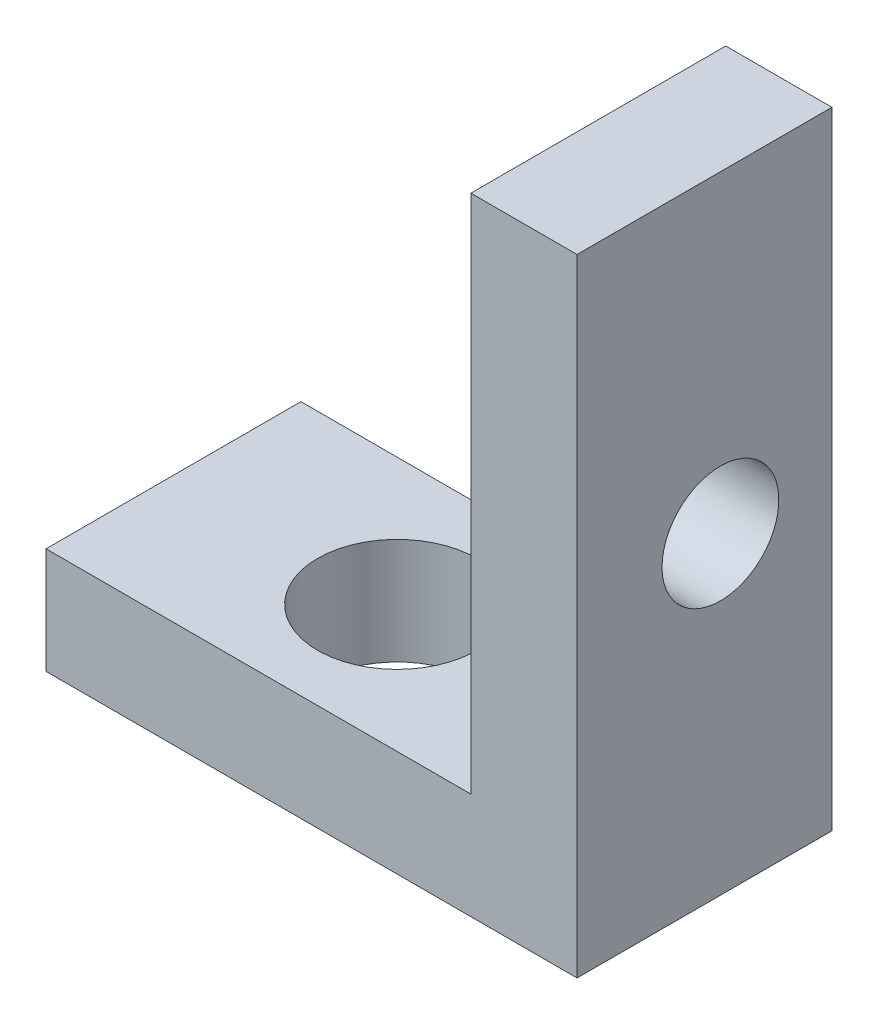
ISO-10303-21;
HEADER;
FILE_DESCRIPTION(('STEP AP214'),'2;1');
FILE_NAME('part.step','',(''),(''),'','','');
FILE_SCHEMA(('AUTOMOTIVE_DESIGN { 1 0 10303 214 1 1 1 1 }'));
ENDSEC;
DATA;
#1=APPLICATION_CONTEXT('core data for automotive mechanical design processes');
#2=APPLICATION_PROTOCOL_DEFINITION('international standard','automotive_design',2000,#1);
#3=PRODUCT_CONTEXT('',#1,'mechanical');
#4=PRODUCT('Part','Part','',(#3));
#5=PRODUCT_RELATED_PRODUCT_CATEGORY('part','',(#4));
#6=PRODUCT_DEFINITION_FORMATION('','',#4);
#7=PRODUCT_DEFINITION_CONTEXT('part definition',#1,'design');
#8=PRODUCT_DEFINITION('design','',#6,#7);
#9=PRODUCT_DEFINITION_SHAPE('','',#8);
#10=(LENGTH_UNIT() NAMED_UNIT(*) SI_UNIT(.MILLI.,.METRE.));
#11=(NAMED_UNIT(*) PLANE_ANGLE_UNIT() SI_UNIT($,.RADIAN.));
#12=(NAMED_UNIT(*) SI_UNIT($,.STERADIAN.) SOLID_ANGLE_UNIT());
#13=UNCERTAINTY_MEASURE_WITH_UNIT(LENGTH_MEASURE(1.E-05),#10,'distance_accuracy_value','');
#14=(GEOMETRIC_REPRESENTATION_CONTEXT(3) GLOBAL_UNCERTAINTY_ASSIGNED_CONTEXT((#13)) GLOBAL_UNIT_ASSIGNED_CONTEXT((#10,
#11,#12)) REPRESENTATION_CONTEXT('',''));
#15=CARTESIAN_POINT('',(0.,0.,0.));
#16=DIRECTION('',(0.,0.,1.));
#17=DIRECTION('',(1.,0.,0.));
#18=AXIS2_PLACEMENT_3D('',#15,#16,#17);
#19=CARTESIAN_POINT('',(0.,0.,4.8));
#20=DIRECTION('',(0.,1.,0.));
#21=DIRECTION('',(-1.,0.,0.));
#22=AXIS2_PLACEMENT_3D('',#19,#20,#21);
#23=PLANE('',#22);
#24=CARTESIAN_POINT('',(-5.78666309704816,0.,2.4));
#25=DIRECTION('',(0.,1.,0.));
#26=DIRECTION('',(-1.,0.,0.));
#27=AXIS2_PLACEMENT_3D('',#24,#25,#26);
#28=CIRCLE('',#27,1.5);
#29=CARTESIAN_POINT('',(-7.28666309704816,0.,2.4));
#30=VERTEX_POINT('',#29);
#31=EDGE_CURVE('E168',#30,#30,#28,.F.);
#32=ORIENTED_EDGE('',*,*,#31,.F.);
#33=EDGE_LOOP('',(#32));
#34=FACE_BOUND('',#33,.T.);
#35=DIRECTION('',(1.,0.,0.));
#36=VECTOR('',#35,1.);
#37=CARTESIAN_POINT('',(0.,0.,0.));
#38=LINE('',#37,#36);
#39=CARTESIAN_POINT('',(-10.,0.,0.));
#40=VERTEX_POINT('',#39);
#41=CARTESIAN_POINT('',(0.,0.,0.));
#42=VERTEX_POINT('',#41);
#43=EDGE_CURVE('E124',#40,#42,#38,.T.);
#44=ORIENTED_EDGE('',*,*,#43,.T.);
#45=DIRECTION('',(0.,0.,-1.));
#46=VECTOR('',#45,1.);
#47=CARTESIAN_POINT('',(0.,0.,4.8));
#48=LINE('',#47,#46);
#49=CARTESIAN_POINT('',(0.,0.,4.8));
#50=VERTEX_POINT('',#49);
#51=EDGE_CURVE('E11',#50,#42,#48,.T.);
#52=ORIENTED_EDGE('',*,*,#51,.F.);
#53=DIRECTION('',(1.,0.,0.));
#54=VECTOR('',#53,1.);
#55=CARTESIAN_POINT('',(0.,0.,4.8));
#56=LINE('',#55,#54);
#57=CARTESIAN_POINT('',(-10.,0.,4.8));
#58=VERTEX_POINT('',#57);
#59=EDGE_CURVE('E135',#58,#50,#56,.T.);
#60=ORIENTED_EDGE('',*,*,#59,.F.);
#61=DIRECTION('',(0.,0.,-1.));
#62=VECTOR('',#61,1.);
#63=CARTESIAN_POINT('',(-10.,0.,4.8));
#64=LINE('',#63,#62);
#65=EDGE_CURVE('E120',#58,#40,#64,.T.);
#66=ORIENTED_EDGE('',*,*,#65,.T.);
#67=EDGE_LOOP('',(#44,#52,#60,#66));
#68=FACE_BOUND('',#67,.T.);
#69=ADVANCED_FACE('F40',(#34,#68),#23,.F.);
#70=CARTESIAN_POINT('',(0.,0.,4.8));
#71=DIRECTION('',(-1.,0.,0.));
#72=DIRECTION('',(0.,0.,1.));
#73=AXIS2_PLACEMENT_3D('',#70,#71,#72);
#74=PLANE('',#73);
#75=CARTESIAN_POINT('',(0.,5.9,2.1));
#76=DIRECTION('',(-1.,0.,0.));
#77=DIRECTION('',(0.,0.,1.));
#78=AXIS2_PLACEMENT_3D('',#75,#76,#77);
#79=CIRCLE('',#78,1.1);
#80=CARTESIAN_POINT('',(0.,5.9,3.2));
#81=VERTEX_POINT('',#80);
#82=EDGE_CURVE('E128',#81,#81,#79,.F.);
#83=ORIENTED_EDGE('',*,*,#82,.F.);
#84=EDGE_LOOP('',(#83));
#85=FACE_BOUND('',#84,.T.);
#86=DIRECTION('',(0.,1.,0.));
#87=VECTOR('',#86,1.);
#88=CARTESIAN_POINT('',(0.,0.,0.));
#89=LINE('',#88,#87);
#90=CARTESIAN_POINT('',(0.,11.8,0.));
#91=VERTEX_POINT('',#90);
#92=EDGE_CURVE('E127',#42,#91,#89,.T.);
#93=ORIENTED_EDGE('',*,*,#92,.T.);
#94=DIRECTION('',(0.,0.,-1.));
#95=VECTOR('',#94,1.);
#96=CARTESIAN_POINT('',(0.,11.8,4.8));
#97=LINE('',#96,#95);
#98=CARTESIAN_POINT('',(0.,11.8,4.8));
#99=VERTEX_POINT('',#98);
#100=EDGE_CURVE('E48',#99,#91,#97,.T.);
#101=ORIENTED_EDGE('',*,*,#100,.F.);
#102=DIRECTION('',(0.,1.,0.));
#103=VECTOR('',#102,1.);
#104=CARTESIAN_POINT('',(0.,0.,4.8));
#105=LINE('',#104,#103);
#106=EDGE_CURVE('E93',#50,#99,#105,.T.);
#107=ORIENTED_EDGE('',*,*,#106,.F.);
#108=ORIENTED_EDGE('',*,*,#51,.T.);
#109=EDGE_LOOP('',(#93,#101,#107,#108));
#110=FACE_BOUND('',#109,.T.);
#111=ADVANCED_FACE('F160',(#85,#110),#74,.F.);
#112=CARTESIAN_POINT('',(0.,11.8,4.8));
#113=DIRECTION('',(0.,-1.,0.));
#114=DIRECTION('',(0.,0.,-1.));
#115=AXIS2_PLACEMENT_3D('',#112,#113,#114);
#116=PLANE('',#115);
#117=DIRECTION('',(-1.,0.,0.));
#118=VECTOR('',#117,1.);
#119=CARTESIAN_POINT('',(0.,11.8,0.));
#120=LINE('',#119,#118);
#121=CARTESIAN_POINT('',(-2.,11.8,0.));
#122=VERTEX_POINT('',#121);
#123=EDGE_CURVE('E130',#91,#122,#120,.T.);
#124=ORIENTED_EDGE('',*,*,#123,.T.);
#125=DIRECTION('',(0.,0.,-1.));
#126=VECTOR('',#125,1.);
#127=CARTESIAN_POINT('',(-2.,11.8,4.8));
#128=LINE('',#127,#126);
#129=CARTESIAN_POINT('',(-2.,11.8,4.8));
#130=VERTEX_POINT('',#129);
#131=EDGE_CURVE('E115',#130,#122,#128,.T.);
#132=ORIENTED_EDGE('',*,*,#131,.F.);
#133=DIRECTION('',(-1.,0.,0.));
#134=VECTOR('',#133,1.);
#135=CARTESIAN_POINT('',(0.,11.8,4.8));
#136=LINE('',#135,#134);
#137=EDGE_CURVE('E106',#99,#130,#136,.T.);
#138=ORIENTED_EDGE('',*,*,#137,.F.);
#139=ORIENTED_EDGE('',*,*,#100,.T.);
#140=EDGE_LOOP('',(#124,#132,#138,#139));
#141=FACE_BOUND('',#140,.T.);
#142=ADVANCED_FACE('F141',(#141),#116,.F.);
#143=CARTESIAN_POINT('',(-2.,2.,4.8));
#144=DIRECTION('',(1.,0.,0.));
#145=DIRECTION('',(0.,0.,-1.));
#146=AXIS2_PLACEMENT_3D('',#143,#144,#145);
#147=PLANE('',#146);
#148=CARTESIAN_POINT('',(-2.,5.9,2.1));
#149=DIRECTION('',(-1.,0.,0.));
#150=DIRECTION('',(0.,0.,1.));
#151=AXIS2_PLACEMENT_3D('',#148,#149,#150);
#152=CIRCLE('',#151,1.1);
#153=CARTESIAN_POINT('',(-2.,5.9,3.2));
#154=VERTEX_POINT('',#153);
#155=EDGE_CURVE('E170',#154,#154,#152,.T.);
#156=ORIENTED_EDGE('',*,*,#155,.F.);
#157=EDGE_LOOP('',(#156));
#158=FACE_BOUND('',#157,.T.);
#159=DIRECTION('',(0.,-1.,0.));
#160=VECTOR('',#159,1.);
#161=CARTESIAN_POINT('',(-2.,2.,0.));
#162=LINE('',#161,#160);
#163=CARTESIAN_POINT('',(-2.,2.,0.));
#164=VERTEX_POINT('',#163);
#165=EDGE_CURVE('E114',#122,#164,#162,.T.);
#166=ORIENTED_EDGE('',*,*,#165,.T.);
#167=DIRECTION('',(0.,0.,-1.));
#168=VECTOR('',#167,1.);
#169=CARTESIAN_POINT('',(-2.,2.,4.8));
#170=LINE('',#169,#168);
#171=CARTESIAN_POINT('',(-2.,2.,4.8));
#172=VERTEX_POINT('',#171);
#173=EDGE_CURVE('E111',#172,#164,#170,.T.);
#174=ORIENTED_EDGE('',*,*,#173,.F.);
#175=DIRECTION('',(0.,-1.,0.));
#176=VECTOR('',#175,1.);
#177=CARTESIAN_POINT('',(-2.,2.,4.8));
#178=LINE('',#177,#176);
#179=EDGE_CURVE('E100',#130,#172,#178,.T.);
#180=ORIENTED_EDGE('',*,*,#179,.F.);
#181=ORIENTED_EDGE('',*,*,#131,.T.);
#182=EDGE_LOOP('',(#166,#174,#180,#181));
#183=FACE_BOUND('',#182,.T.);
#184=ADVANCED_FACE('F112',(#158,#183),#147,.F.);
#185=CARTESIAN_POINT('',(-2.,2.,4.8));
#186=DIRECTION('',(0.,-1.,0.));
#187=DIRECTION('',(1.,0.,0.));
#188=AXIS2_PLACEMENT_3D('',#185,#186,#187);
#189=PLANE('',#188);
#190=CARTESIAN_POINT('',(-5.78666309704816,2.,2.4));
#191=DIRECTION('',(0.,1.,0.));
#192=DIRECTION('',(-1.,0.,0.));
#193=AXIS2_PLACEMENT_3D('',#190,#191,#192);
#194=CIRCLE('',#193,1.5);
#195=CARTESIAN_POINT('',(-7.28666309704816,2.,2.4));
#196=VERTEX_POINT('',#195);
#197=EDGE_CURVE('E171',#196,#196,#194,.T.);
#198=ORIENTED_EDGE('',*,*,#197,.F.);
#199=EDGE_LOOP('',(#198));
#200=FACE_BOUND('',#199,.T.);
#201=DIRECTION('',(-1.,0.,0.));
#202=VECTOR('',#201,1.);
#203=CARTESIAN_POINT('',(-2.,2.,0.));
#204=LINE('',#203,#202);
#205=CARTESIAN_POINT('',(-10.,2.,0.));
#206=VERTEX_POINT('',#205);
#207=EDGE_CURVE('E79',#164,#206,#204,.T.);
#208=ORIENTED_EDGE('',*,*,#207,.T.);
#209=DIRECTION('',(0.,0.,-1.));
#210=VECTOR('',#209,1.);
#211=CARTESIAN_POINT('',(-10.,2.,4.8));
#212=LINE('',#211,#210);
#213=CARTESIAN_POINT('',(-10.,2.,4.8));
#214=VERTEX_POINT('',#213);
#215=EDGE_CURVE('E116',#214,#206,#212,.T.);
#216=ORIENTED_EDGE('',*,*,#215,.F.);
#217=DIRECTION('',(-1.,0.,0.));
#218=VECTOR('',#217,1.);
#219=CARTESIAN_POINT('',(-2.,2.,4.8));
#220=LINE('',#219,#218);
#221=EDGE_CURVE('E104',#172,#214,#220,.T.);
#222=ORIENTED_EDGE('',*,*,#221,.F.);
#223=ORIENTED_EDGE('',*,*,#173,.T.);
#224=EDGE_LOOP('',(#208,#216,#222,#223));
#225=FACE_BOUND('',#224,.T.);
#226=ADVANCED_FACE('F118',(#200,#225),#189,.F.);
#227=CARTESIAN_POINT('',(-10.,0.,4.8));
#228=DIRECTION('',(1.,0.,0.));
#229=DIRECTION('',(0.,0.,-1.));
#230=AXIS2_PLACEMENT_3D('',#227,#228,#229);
#231=PLANE('',#230);
#232=DIRECTION('',(0.,-1.,0.));
#233=VECTOR('',#232,1.);
#234=CARTESIAN_POINT('',(-10.,0.,0.));
#235=LINE('',#234,#233);
#236=EDGE_CURVE('E85',#206,#40,#235,.T.);
#237=ORIENTED_EDGE('',*,*,#236,.T.);
#238=ORIENTED_EDGE('',*,*,#65,.F.);
#239=DIRECTION('',(0.,-1.,0.));
#240=VECTOR('',#239,1.);
#241=CARTESIAN_POINT('',(-10.,0.,4.8));
#242=LINE('',#241,#240);
#243=EDGE_CURVE('E56',#214,#58,#242,.T.);
#244=ORIENTED_EDGE('',*,*,#243,.F.);
#245=ORIENTED_EDGE('',*,*,#215,.T.);
#246=EDGE_LOOP('',(#237,#238,#244,#245));
#247=FACE_BOUND('',#246,.T.);
#248=ADVANCED_FACE('F148',(#247),#231,.F.);
#249=CARTESIAN_POINT('',(0.,0.,4.8));
#250=DIRECTION('',(0.,0.,-1.));
#251=DIRECTION('',(-1.,0.,0.));
#252=AXIS2_PLACEMENT_3D('',#249,#250,#251);
#253=PLANE('',#252);
#254=ORIENTED_EDGE('',*,*,#59,.T.);
#255=ORIENTED_EDGE('',*,*,#106,.T.);
#256=ORIENTED_EDGE('',*,*,#137,.T.);
#257=ORIENTED_EDGE('',*,*,#179,.T.);
#258=ORIENTED_EDGE('',*,*,#221,.T.);
#259=ORIENTED_EDGE('',*,*,#243,.T.);
#260=EDGE_LOOP('',(#254,#255,#256,#257,#258,#259));
#261=FACE_BOUND('',#260,.T.);
#262=ADVANCED_FACE('F102',(#261),#253,.F.);
#263=CARTESIAN_POINT('',(0.,0.,0.));
#264=DIRECTION('',(0.,0.,-1.));
#265=DIRECTION('',(-1.,0.,0.));
#266=AXIS2_PLACEMENT_3D('',#263,#264,#265);
#267=PLANE('',#266);
#268=ORIENTED_EDGE('',*,*,#43,.F.);
#269=ORIENTED_EDGE('',*,*,#236,.F.);
#270=ORIENTED_EDGE('',*,*,#207,.F.);
#271=ORIENTED_EDGE('',*,*,#165,.F.);
#272=ORIENTED_EDGE('',*,*,#123,.F.);
#273=ORIENTED_EDGE('',*,*,#92,.F.);
#274=EDGE_LOOP('',(#268,#269,#270,#271,#272,#273));
#275=FACE_BOUND('',#274,.T.);
#276=ADVANCED_FACE('F144',(#275),#267,.T.);
#277=CARTESIAN_POINT('',(0.00100000000000013,5.9,2.1));
#278=DIRECTION('',(-1.,0.,0.));
#279=DIRECTION('',(0.,0.,1.));
#280=AXIS2_PLACEMENT_3D('',#277,#278,#279);
#281=CYLINDRICAL_SURFACE('',#280,1.1);
#282=ORIENTED_EDGE('',*,*,#155,.T.);
#283=EDGE_LOOP('',(#282));
#284=FACE_BOUND('',#283,.T.);
#285=ORIENTED_EDGE('',*,*,#82,.T.);
#286=EDGE_LOOP('',(#285));
#287=FACE_BOUND('',#286,.T.);
#288=ADVANCED_FACE('F183',(#284,#287),#281,.F.);
#289=CARTESIAN_POINT('',(-5.78666309704816,-0.0010000000000023,2.4));
#290=DIRECTION('',(0.,1.,0.));
#291=DIRECTION('',(-1.,0.,0.));
#292=AXIS2_PLACEMENT_3D('',#289,#290,#291);
#293=CYLINDRICAL_SURFACE('',#292,1.5);
#294=ORIENTED_EDGE('',*,*,#197,.T.);
#295=EDGE_LOOP('',(#294));
#296=FACE_BOUND('',#295,.T.);
#297=ORIENTED_EDGE('',*,*,#31,.T.);
#298=EDGE_LOOP('',(#297));
#299=FACE_BOUND('',#298,.T.);
#300=ADVANCED_FACE('F185',(#296,#299),#293,.F.);
#301=CLOSED_SHELL('',(#69,#111,#142,#184,#226,#248,#262,#276,#288,#300));
#302=MANIFOLD_SOLID_BREP('B2',#301);
#303=ADVANCED_BREP_SHAPE_REPRESENTATION('',(#18,#302),#14);
#304=SHAPE_DEFINITION_REPRESENTATION(#9,#303);
ENDSEC;
END-ISO-10303-21;
